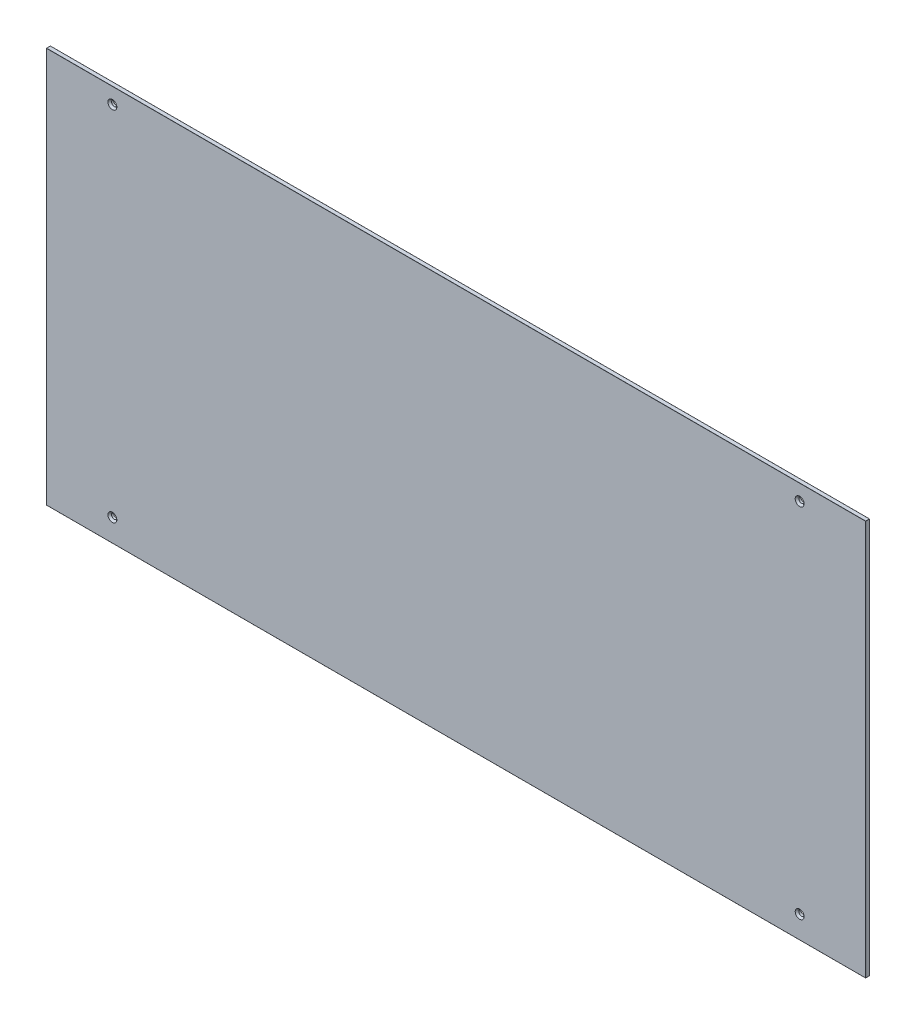
ISO-10303-21;
HEADER;
FILE_DESCRIPTION(('STEP AP214'),'2;1');
FILE_NAME('part.step','',(''),(''),'','','');
FILE_SCHEMA(('AUTOMOTIVE_DESIGN { 1 0 10303 214 1 1 1 1 }'));
ENDSEC;
DATA;
#1=APPLICATION_CONTEXT('core data for automotive mechanical design processes');
#2=APPLICATION_PROTOCOL_DEFINITION('international standard','automotive_design',2000,#1);
#3=PRODUCT_CONTEXT('',#1,'mechanical');
#4=PRODUCT('Part','Part','',(#3));
#5=PRODUCT_RELATED_PRODUCT_CATEGORY('part','',(#4));
#6=PRODUCT_DEFINITION_FORMATION('','',#4);
#7=PRODUCT_DEFINITION_CONTEXT('part definition',#1,'design');
#8=PRODUCT_DEFINITION('design','',#6,#7);
#9=PRODUCT_DEFINITION_SHAPE('','',#8);
#10=(LENGTH_UNIT() NAMED_UNIT(*) SI_UNIT(.MILLI.,.METRE.));
#11=(NAMED_UNIT(*) PLANE_ANGLE_UNIT() SI_UNIT($,.RADIAN.));
#12=(NAMED_UNIT(*) SI_UNIT($,.STERADIAN.) SOLID_ANGLE_UNIT());
#13=UNCERTAINTY_MEASURE_WITH_UNIT(LENGTH_MEASURE(1.E-05),#10,'distance_accuracy_value','');
#14=(GEOMETRIC_REPRESENTATION_CONTEXT(3) GLOBAL_UNCERTAINTY_ASSIGNED_CONTEXT((#13)) GLOBAL_UNIT_ASSIGNED_CONTEXT((#10,
#11,#12)) REPRESENTATION_CONTEXT('',''));
#15=CARTESIAN_POINT('',(0.,0.,0.));
#16=DIRECTION('',(0.,0.,1.));
#17=DIRECTION('',(1.,0.,0.));
#18=AXIS2_PLACEMENT_3D('',#15,#16,#17);
#19=CARTESIAN_POINT('',(621.,-300.,6.));
#20=DIRECTION('',(-1.,0.,0.));
#21=DIRECTION('',(0.,0.,1.));
#22=AXIS2_PLACEMENT_3D('',#19,#20,#21);
#23=PLANE('',#22);
#24=DIRECTION('',(0.,0.,-1.));
#25=VECTOR('',#24,1.);
#26=CARTESIAN_POINT('',(621.,-299.8,6.));
#27=LINE('',#26,#25);
#28=CARTESIAN_POINT('',(621.,-299.8,5.8));
#29=VERTEX_POINT('',#28);
#30=CARTESIAN_POINT('',(621.,-299.8,0.2));
#31=VERTEX_POINT('',#30);
#32=EDGE_CURVE('E180',#29,#31,#27,.T.);
#33=ORIENTED_EDGE('',*,*,#32,.T.);
#34=DIRECTION('',(0.,1.,0.));
#35=VECTOR('',#34,1.);
#36=CARTESIAN_POINT('',(621.,300.,0.2));
#37=LINE('',#36,#35);
#38=CARTESIAN_POINT('',(621.,299.8,0.2));
#39=VERTEX_POINT('',#38);
#40=EDGE_CURVE('E182',#31,#39,#37,.T.);
#41=ORIENTED_EDGE('',*,*,#40,.T.);
#42=DIRECTION('',(0.,0.,-1.));
#43=VECTOR('',#42,1.);
#44=CARTESIAN_POINT('',(621.,299.8,6.));
#45=LINE('',#44,#43);
#46=CARTESIAN_POINT('',(621.,299.8,5.8));
#47=VERTEX_POINT('',#46);
#48=EDGE_CURVE('E176',#39,#47,#45,.F.);
#49=ORIENTED_EDGE('',*,*,#48,.T.);
#50=DIRECTION('',(0.,1.,0.));
#51=VECTOR('',#50,1.);
#52=CARTESIAN_POINT('',(621.,-300.,5.8));
#53=LINE('',#52,#51);
#54=EDGE_CURVE('E178',#47,#29,#53,.F.);
#55=ORIENTED_EDGE('',*,*,#54,.T.);
#56=EDGE_LOOP('',(#33,#41,#49,#55));
#57=FACE_BOUND('',#56,.T.);
#58=ADVANCED_FACE('F32',(#57),#23,.F.);
#59=CARTESIAN_POINT('',(-621.,300.,6.));
#60=DIRECTION('',(0.,-1.,0.));
#61=DIRECTION('',(0.,0.,-1.));
#62=AXIS2_PLACEMENT_3D('',#59,#60,#61);
#63=PLANE('',#62);
#64=DIRECTION('',(-1.,0.,0.));
#65=VECTOR('',#64,1.);
#66=CARTESIAN_POINT('',(-621.,300.,5.8));
#67=LINE('',#66,#65);
#68=CARTESIAN_POINT('',(-620.8,300.,5.8));
#69=VERTEX_POINT('',#68);
#70=CARTESIAN_POINT('',(620.8,300.,5.8));
#71=VERTEX_POINT('',#70);
#72=EDGE_CURVE('E194',#69,#71,#67,.F.);
#73=ORIENTED_EDGE('',*,*,#72,.T.);
#74=DIRECTION('',(0.,0.,-1.));
#75=VECTOR('',#74,1.);
#76=CARTESIAN_POINT('',(620.8,300.,6.));
#77=LINE('',#76,#75);
#78=CARTESIAN_POINT('',(620.8,300.,0.2));
#79=VERTEX_POINT('',#78);
#80=EDGE_CURVE('E198',#71,#79,#77,.T.);
#81=ORIENTED_EDGE('',*,*,#80,.T.);
#82=DIRECTION('',(-1.,0.,0.));
#83=VECTOR('',#82,1.);
#84=CARTESIAN_POINT('',(-621.,300.,0.2));
#85=LINE('',#84,#83);
#86=CARTESIAN_POINT('',(-620.8,300.,0.2));
#87=VERTEX_POINT('',#86);
#88=EDGE_CURVE('E196',#79,#87,#85,.T.);
#89=ORIENTED_EDGE('',*,*,#88,.T.);
#90=DIRECTION('',(0.,0.,-1.));
#91=VECTOR('',#90,1.);
#92=CARTESIAN_POINT('',(-620.8,300.,6.));
#93=LINE('',#92,#91);
#94=EDGE_CURVE('E192',#87,#69,#93,.F.);
#95=ORIENTED_EDGE('',*,*,#94,.T.);
#96=EDGE_LOOP('',(#73,#81,#89,#95));
#97=FACE_BOUND('',#96,.T.);
#98=ADVANCED_FACE('F317',(#97),#63,.F.);
#99=CARTESIAN_POINT('',(-621.,-300.,6.));
#100=DIRECTION('',(1.,0.,0.));
#101=DIRECTION('',(0.,0.,-1.));
#102=AXIS2_PLACEMENT_3D('',#99,#100,#101);
#103=PLANE('',#102);
#104=DIRECTION('',(0.,-1.,0.));
#105=VECTOR('',#104,1.);
#106=CARTESIAN_POINT('',(-621.,-300.,0.2));
#107=LINE('',#106,#105);
#108=CARTESIAN_POINT('',(-621.,299.8,0.2));
#109=VERTEX_POINT('',#108);
#110=CARTESIAN_POINT('',(-621.,-299.8,0.2));
#111=VERTEX_POINT('',#110);
#112=EDGE_CURVE('E41',#109,#111,#107,.T.);
#113=ORIENTED_EDGE('',*,*,#112,.T.);
#114=DIRECTION('',(0.,0.,-1.));
#115=VECTOR('',#114,1.);
#116=CARTESIAN_POINT('',(-621.,-299.8,6.));
#117=LINE('',#116,#115);
#118=CARTESIAN_POINT('',(-621.,-299.8,5.8));
#119=VERTEX_POINT('',#118);
#120=EDGE_CURVE('E11',#111,#119,#117,.F.);
#121=ORIENTED_EDGE('',*,*,#120,.T.);
#122=DIRECTION('',(0.,-1.,0.));
#123=VECTOR('',#122,1.);
#124=CARTESIAN_POINT('',(-621.,-300.,5.8));
#125=LINE('',#124,#123);
#126=CARTESIAN_POINT('',(-621.,299.8,5.8));
#127=VERTEX_POINT('',#126);
#128=EDGE_CURVE('E201',#119,#127,#125,.F.);
#129=ORIENTED_EDGE('',*,*,#128,.T.);
#130=DIRECTION('',(0.,0.,-1.));
#131=VECTOR('',#130,1.);
#132=CARTESIAN_POINT('',(-621.,299.8,6.));
#133=LINE('',#132,#131);
#134=EDGE_CURVE('E52',#127,#109,#133,.T.);
#135=ORIENTED_EDGE('',*,*,#134,.T.);
#136=EDGE_LOOP('',(#113,#121,#129,#135));
#137=FACE_BOUND('',#136,.T.);
#138=ADVANCED_FACE('F323',(#137),#103,.F.);
#139=CARTESIAN_POINT('',(-621.,-300.,6.));
#140=DIRECTION('',(0.,1.,0.));
#141=DIRECTION('',(0.,0.,1.));
#142=AXIS2_PLACEMENT_3D('',#139,#140,#141);
#143=PLANE('',#142);
#144=DIRECTION('',(0.,0.,-1.));
#145=VECTOR('',#144,1.);
#146=CARTESIAN_POINT('',(-620.8,-300.,6.));
#147=LINE('',#146,#145);
#148=CARTESIAN_POINT('',(-620.8,-300.,5.8));
#149=VERTEX_POINT('',#148);
#150=CARTESIAN_POINT('',(-620.8,-300.,0.2));
#151=VERTEX_POINT('',#150);
#152=EDGE_CURVE('E125',#149,#151,#147,.T.);
#153=ORIENTED_EDGE('',*,*,#152,.T.);
#154=DIRECTION('',(1.,0.,0.));
#155=VECTOR('',#154,1.);
#156=CARTESIAN_POINT('',(621.,-300.,0.2));
#157=LINE('',#156,#155);
#158=CARTESIAN_POINT('',(620.8,-300.,0.2));
#159=VERTEX_POINT('',#158);
#160=EDGE_CURVE('E165',#151,#159,#157,.T.);
#161=ORIENTED_EDGE('',*,*,#160,.T.);
#162=DIRECTION('',(0.,0.,-1.));
#163=VECTOR('',#162,1.);
#164=CARTESIAN_POINT('',(620.8,-300.,6.));
#165=LINE('',#164,#163);
#166=CARTESIAN_POINT('',(620.8,-300.,5.8));
#167=VERTEX_POINT('',#166);
#168=EDGE_CURVE('E128',#159,#167,#165,.F.);
#169=ORIENTED_EDGE('',*,*,#168,.T.);
#170=DIRECTION('',(1.,0.,0.));
#171=VECTOR('',#170,1.);
#172=CARTESIAN_POINT('',(-621.,-300.,5.8));
#173=LINE('',#172,#171);
#174=EDGE_CURVE('E120',#167,#149,#173,.F.);
#175=ORIENTED_EDGE('',*,*,#174,.T.);
#176=EDGE_LOOP('',(#153,#161,#169,#175));
#177=FACE_BOUND('',#176,.T.);
#178=ADVANCED_FACE('F122',(#177),#143,.F.);
#179=CARTESIAN_POINT('',(0.,0.,6.));
#180=DIRECTION('',(0.,0.,-1.));
#181=DIRECTION('',(-1.,0.,0.));
#182=AXIS2_PLACEMENT_3D('',#179,#180,#181);
#183=PLANE('',#182);
#184=DIRECTION('',(0.,-1.,0.));
#185=VECTOR('',#184,1.);
#186=CARTESIAN_POINT('',(-620.8,0.,6.));
#187=LINE('',#186,#185);
#188=CARTESIAN_POINT('',(-620.8,299.8,6.));
#189=VERTEX_POINT('',#188);
#190=CARTESIAN_POINT('',(-620.8,-299.8,6.));
#191=VERTEX_POINT('',#190);
#192=EDGE_CURVE('E185',#189,#191,#187,.T.);
#193=ORIENTED_EDGE('',*,*,#192,.T.);
#194=DIRECTION('',(1.,0.,0.));
#195=VECTOR('',#194,1.);
#196=CARTESIAN_POINT('',(0.,-299.8,6.));
#197=LINE('',#196,#195);
#198=CARTESIAN_POINT('',(620.8,-299.8,6.));
#199=VERTEX_POINT('',#198);
#200=EDGE_CURVE('E139',#191,#199,#197,.T.);
#201=ORIENTED_EDGE('',*,*,#200,.T.);
#202=DIRECTION('',(0.,1.,0.));
#203=VECTOR('',#202,1.);
#204=CARTESIAN_POINT('',(620.8,0.,6.));
#205=LINE('',#204,#203);
#206=CARTESIAN_POINT('',(620.8,299.8,6.));
#207=VERTEX_POINT('',#206);
#208=EDGE_CURVE('E189',#199,#207,#205,.T.);
#209=ORIENTED_EDGE('',*,*,#208,.T.);
#210=DIRECTION('',(-1.,0.,0.));
#211=VECTOR('',#210,1.);
#212=CARTESIAN_POINT('',(0.,299.8,6.));
#213=LINE('',#212,#211);
#214=EDGE_CURVE('E187',#207,#189,#213,.T.);
#215=ORIENTED_EDGE('',*,*,#214,.T.);
#216=EDGE_LOOP('',(#193,#201,#209,#215));
#217=FACE_BOUND('',#216,.T.);
#218=CARTESIAN_POINT('',(-521.,-266.,6.));
#219=DIRECTION('',(0.,0.,-1.));
#220=DIRECTION('',(-1.,0.,0.));
#221=AXIS2_PLACEMENT_3D('',#218,#219,#220);
#222=CIRCLE('',#221,6.75000000000014);
#223=CARTESIAN_POINT('',(-527.75,-266.,6.));
#224=VERTEX_POINT('',#223);
#225=EDGE_CURVE('E289',#224,#224,#222,.T.);
#226=ORIENTED_EDGE('',*,*,#225,.T.);
#227=EDGE_LOOP('',(#226));
#228=FACE_BOUND('',#227,.T.);
#229=CARTESIAN_POINT('',(521.,-266.,6.));
#230=DIRECTION('',(0.,0.,-1.));
#231=DIRECTION('',(-1.,0.,0.));
#232=AXIS2_PLACEMENT_3D('',#229,#230,#231);
#233=CIRCLE('',#232,6.75000000000014);
#234=CARTESIAN_POINT('',(514.25,-266.,6.));
#235=VERTEX_POINT('',#234);
#236=EDGE_CURVE('E286',#235,#235,#233,.T.);
#237=ORIENTED_EDGE('',*,*,#236,.T.);
#238=EDGE_LOOP('',(#237));
#239=FACE_BOUND('',#238,.T.);
#240=CARTESIAN_POINT('',(521.,276.,6.));
#241=DIRECTION('',(0.,0.,-1.));
#242=DIRECTION('',(-1.,0.,0.));
#243=AXIS2_PLACEMENT_3D('',#240,#241,#242);
#244=CIRCLE('',#243,6.75000000000014);
#245=CARTESIAN_POINT('',(514.25,276.,6.));
#246=VERTEX_POINT('',#245);
#247=EDGE_CURVE('E283',#246,#246,#244,.T.);
#248=ORIENTED_EDGE('',*,*,#247,.T.);
#249=EDGE_LOOP('',(#248));
#250=FACE_BOUND('',#249,.T.);
#251=CARTESIAN_POINT('',(-521.,276.,6.));
#252=DIRECTION('',(0.,0.,-1.));
#253=DIRECTION('',(-1.,0.,0.));
#254=AXIS2_PLACEMENT_3D('',#251,#252,#253);
#255=CIRCLE('',#254,6.75000000000014);
#256=CARTESIAN_POINT('',(-527.75,276.,6.));
#257=VERTEX_POINT('',#256);
#258=EDGE_CURVE('E280',#257,#257,#255,.T.);
#259=ORIENTED_EDGE('',*,*,#258,.T.);
#260=EDGE_LOOP('',(#259));
#261=FACE_BOUND('',#260,.T.);
#262=ADVANCED_FACE('F342',(#217,#228,#239,#250,#261),#183,.F.);
#263=CARTESIAN_POINT('',(0.,0.,0.));
#264=DIRECTION('',(0.,0.,-1.));
#265=DIRECTION('',(-1.,0.,0.));
#266=AXIS2_PLACEMENT_3D('',#263,#264,#265);
#267=PLANE('',#266);
#268=DIRECTION('',(0.,1.,0.));
#269=VECTOR('',#268,1.);
#270=CARTESIAN_POINT('',(620.8,-300.,0.));
#271=LINE('',#270,#269);
#272=CARTESIAN_POINT('',(620.8,299.8,0.));
#273=VERTEX_POINT('',#272);
#274=CARTESIAN_POINT('',(620.8,-299.8,0.));
#275=VERTEX_POINT('',#274);
#276=EDGE_CURVE('E171',#273,#275,#271,.F.);
#277=ORIENTED_EDGE('',*,*,#276,.T.);
#278=DIRECTION('',(1.,0.,0.));
#279=VECTOR('',#278,1.);
#280=CARTESIAN_POINT('',(-621.,-299.8,0.));
#281=LINE('',#280,#279);
#282=CARTESIAN_POINT('',(-620.8,-299.8,0.));
#283=VERTEX_POINT('',#282);
#284=EDGE_CURVE('E173',#275,#283,#281,.F.);
#285=ORIENTED_EDGE('',*,*,#284,.T.);
#286=DIRECTION('',(0.,-1.,0.));
#287=VECTOR('',#286,1.);
#288=CARTESIAN_POINT('',(-620.8,300.,0.));
#289=LINE('',#288,#287);
#290=CARTESIAN_POINT('',(-620.8,299.8,0.));
#291=VERTEX_POINT('',#290);
#292=EDGE_CURVE('E167',#283,#291,#289,.F.);
#293=ORIENTED_EDGE('',*,*,#292,.T.);
#294=DIRECTION('',(-1.,0.,0.));
#295=VECTOR('',#294,1.);
#296=CARTESIAN_POINT('',(621.,299.8,0.));
#297=LINE('',#296,#295);
#298=EDGE_CURVE('E169',#291,#273,#297,.F.);
#299=ORIENTED_EDGE('',*,*,#298,.T.);
#300=EDGE_LOOP('',(#277,#285,#293,#299));
#301=FACE_BOUND('',#300,.T.);
#302=CARTESIAN_POINT('',(-521.,-266.,0.));
#303=DIRECTION('',(0.,0.,1.));
#304=DIRECTION('',(1.,0.,0.));
#305=AXIS2_PLACEMENT_3D('',#302,#303,#304);
#306=CIRCLE('',#305,3.99999999999999);
#307=CARTESIAN_POINT('',(-517.,-266.,0.));
#308=VERTEX_POINT('',#307);
#309=EDGE_CURVE('E258',#308,#308,#306,.T.);
#310=ORIENTED_EDGE('',*,*,#309,.T.);
#311=EDGE_LOOP('',(#310));
#312=FACE_BOUND('',#311,.T.);
#313=CARTESIAN_POINT('',(521.,-266.,0.));
#314=DIRECTION('',(0.,0.,1.));
#315=DIRECTION('',(1.,0.,0.));
#316=AXIS2_PLACEMENT_3D('',#313,#314,#315);
#317=CIRCLE('',#316,3.99999999999999);
#318=CARTESIAN_POINT('',(525.,-266.,0.));
#319=VERTEX_POINT('',#318);
#320=EDGE_CURVE('E264',#319,#319,#317,.T.);
#321=ORIENTED_EDGE('',*,*,#320,.T.);
#322=EDGE_LOOP('',(#321));
#323=FACE_BOUND('',#322,.T.);
#324=CARTESIAN_POINT('',(521.,276.,0.));
#325=DIRECTION('',(0.,0.,1.));
#326=DIRECTION('',(1.,0.,0.));
#327=AXIS2_PLACEMENT_3D('',#324,#325,#326);
#328=CIRCLE('',#327,3.99999999999999);
#329=CARTESIAN_POINT('',(525.,276.,0.));
#330=VERTEX_POINT('',#329);
#331=EDGE_CURVE('E269',#330,#330,#328,.T.);
#332=ORIENTED_EDGE('',*,*,#331,.T.);
#333=EDGE_LOOP('',(#332));
#334=FACE_BOUND('',#333,.T.);
#335=CARTESIAN_POINT('',(-521.,276.,0.));
#336=DIRECTION('',(0.,0.,1.));
#337=DIRECTION('',(1.,0.,0.));
#338=AXIS2_PLACEMENT_3D('',#335,#336,#337);
#339=CIRCLE('',#338,3.99999999999999);
#340=CARTESIAN_POINT('',(-517.,276.,0.));
#341=VERTEX_POINT('',#340);
#342=EDGE_CURVE('E274',#341,#341,#339,.T.);
#343=ORIENTED_EDGE('',*,*,#342,.T.);
#344=EDGE_LOOP('',(#343));
#345=FACE_BOUND('',#344,.T.);
#346=ADVANCED_FACE('F345',(#301,#312,#323,#334,#345),#267,.T.);
#347=CARTESIAN_POINT('',(-521.,276.,0.));
#348=DIRECTION('',(0.,0.,1.));
#349=DIRECTION('',(1.,0.,0.));
#350=AXIS2_PLACEMENT_3D('',#347,#348,#349);
#351=CYLINDRICAL_SURFACE('',#350,3.99999999999999);
#352=CARTESIAN_POINT('',(-521.,276.,3.24999999999983));
#353=DIRECTION('',(0.,0.,-1.));
#354=DIRECTION('',(-1.,0.,0.));
#355=AXIS2_PLACEMENT_3D('',#352,#353,#354);
#356=CIRCLE('',#355,3.99999999999999);
#357=CARTESIAN_POINT('',(-525.,276.,3.24999999999983));
#358=VERTEX_POINT('',#357);
#359=EDGE_CURVE('E157',#358,#358,#356,.F.);
#360=ORIENTED_EDGE('',*,*,#359,.T.);
#361=EDGE_LOOP('',(#360));
#362=FACE_BOUND('',#361,.T.);
#363=ORIENTED_EDGE('',*,*,#342,.F.);
#364=EDGE_LOOP('',(#363));
#365=FACE_BOUND('',#364,.T.);
#366=ADVANCED_FACE('F355',(#362,#365),#351,.F.);
#367=CARTESIAN_POINT('',(521.,276.,0.));
#368=DIRECTION('',(0.,0.,1.));
#369=DIRECTION('',(1.,0.,0.));
#370=AXIS2_PLACEMENT_3D('',#367,#368,#369);
#371=CYLINDRICAL_SURFACE('',#370,3.99999999999999);
#372=CARTESIAN_POINT('',(521.,276.,3.24999999999983));
#373=DIRECTION('',(0.,0.,-1.));
#374=DIRECTION('',(-1.,0.,0.));
#375=AXIS2_PLACEMENT_3D('',#372,#373,#374);
#376=CIRCLE('',#375,3.99999999999999);
#377=CARTESIAN_POINT('',(517.,276.,3.24999999999983));
#378=VERTEX_POINT('',#377);
#379=EDGE_CURVE('E160',#378,#378,#376,.F.);
#380=ORIENTED_EDGE('',*,*,#379,.T.);
#381=EDGE_LOOP('',(#380));
#382=FACE_BOUND('',#381,.T.);
#383=ORIENTED_EDGE('',*,*,#331,.F.);
#384=EDGE_LOOP('',(#383));
#385=FACE_BOUND('',#384,.T.);
#386=ADVANCED_FACE('F297',(#382,#385),#371,.F.);
#387=CARTESIAN_POINT('',(521.,-266.,0.));
#388=DIRECTION('',(0.,0.,1.));
#389=DIRECTION('',(1.,0.,0.));
#390=AXIS2_PLACEMENT_3D('',#387,#388,#389);
#391=CYLINDRICAL_SURFACE('',#390,3.99999999999999);
#392=CARTESIAN_POINT('',(521.,-266.,3.24999999999983));
#393=DIRECTION('',(0.,0.,-1.));
#394=DIRECTION('',(-1.,0.,0.));
#395=AXIS2_PLACEMENT_3D('',#392,#393,#394);
#396=CIRCLE('',#395,3.99999999999999);
#397=CARTESIAN_POINT('',(517.,-266.,3.24999999999983));
#398=VERTEX_POINT('',#397);
#399=EDGE_CURVE('E292',#398,#398,#396,.F.);
#400=ORIENTED_EDGE('',*,*,#399,.T.);
#401=EDGE_LOOP('',(#400));
#402=FACE_BOUND('',#401,.T.);
#403=ORIENTED_EDGE('',*,*,#320,.F.);
#404=EDGE_LOOP('',(#403));
#405=FACE_BOUND('',#404,.T.);
#406=ADVANCED_FACE('F334',(#402,#405),#391,.F.);
#407=CARTESIAN_POINT('',(-521.,-266.,0.));
#408=DIRECTION('',(0.,0.,1.));
#409=DIRECTION('',(1.,0.,0.));
#410=AXIS2_PLACEMENT_3D('',#407,#408,#409);
#411=CYLINDRICAL_SURFACE('',#410,3.99999999999999);
#412=CARTESIAN_POINT('',(-521.,-266.,3.24999999999983));
#413=DIRECTION('',(0.,0.,-1.));
#414=DIRECTION('',(-1.,0.,0.));
#415=AXIS2_PLACEMENT_3D('',#412,#413,#414);
#416=CIRCLE('',#415,3.99999999999999);
#417=CARTESIAN_POINT('',(-525.,-266.,3.24999999999983));
#418=VERTEX_POINT('',#417);
#419=EDGE_CURVE('E277',#418,#418,#416,.F.);
#420=ORIENTED_EDGE('',*,*,#419,.T.);
#421=EDGE_LOOP('',(#420));
#422=FACE_BOUND('',#421,.T.);
#423=ORIENTED_EDGE('',*,*,#309,.F.);
#424=EDGE_LOOP('',(#423));
#425=FACE_BOUND('',#424,.T.);
#426=ADVANCED_FACE('F329',(#422,#425),#411,.F.);
#427=CARTESIAN_POINT('',(-521.,-266.,3.24999999999983));
#428=DIRECTION('',(0.,0.,1.));
#429=DIRECTION('',(1.,0.,0.));
#430=AXIS2_PLACEMENT_3D('',#427,#428,#429);
#431=CONICAL_SURFACE('',#430,3.99999999999999,0.785398163397446);
#432=ORIENTED_EDGE('',*,*,#225,.F.);
#433=EDGE_LOOP('',(#432));
#434=FACE_BOUND('',#433,.T.);
#435=ORIENTED_EDGE('',*,*,#419,.F.);
#436=EDGE_LOOP('',(#435));
#437=FACE_BOUND('',#436,.T.);
#438=ADVANCED_FACE('F312',(#434,#437),#431,.F.);
#439=CARTESIAN_POINT('',(521.,-266.,3.24999999999983));
#440=DIRECTION('',(0.,0.,1.));
#441=DIRECTION('',(1.,0.,0.));
#442=AXIS2_PLACEMENT_3D('',#439,#440,#441);
#443=CONICAL_SURFACE('',#442,3.99999999999999,0.785398163397446);
#444=ORIENTED_EDGE('',*,*,#236,.F.);
#445=EDGE_LOOP('',(#444));
#446=FACE_BOUND('',#445,.T.);
#447=ORIENTED_EDGE('',*,*,#399,.F.);
#448=EDGE_LOOP('',(#447));
#449=FACE_BOUND('',#448,.T.);
#450=ADVANCED_FACE('F303',(#446,#449),#443,.F.);
#451=CARTESIAN_POINT('',(521.,276.,3.24999999999983));
#452=DIRECTION('',(0.,0.,1.));
#453=DIRECTION('',(1.,0.,0.));
#454=AXIS2_PLACEMENT_3D('',#451,#452,#453);
#455=CONICAL_SURFACE('',#454,3.99999999999999,0.785398163397446);
#456=ORIENTED_EDGE('',*,*,#247,.F.);
#457=EDGE_LOOP('',(#456));
#458=FACE_BOUND('',#457,.T.);
#459=ORIENTED_EDGE('',*,*,#379,.F.);
#460=EDGE_LOOP('',(#459));
#461=FACE_BOUND('',#460,.T.);
#462=ADVANCED_FACE('F300',(#458,#461),#455,.F.);
#463=CARTESIAN_POINT('',(-521.,276.,3.24999999999983));
#464=DIRECTION('',(0.,0.,1.));
#465=DIRECTION('',(1.,0.,0.));
#466=AXIS2_PLACEMENT_3D('',#463,#464,#465);
#467=CONICAL_SURFACE('',#466,3.99999999999999,0.785398163397446);
#468=ORIENTED_EDGE('',*,*,#258,.F.);
#469=EDGE_LOOP('',(#468));
#470=FACE_BOUND('',#469,.T.);
#471=ORIENTED_EDGE('',*,*,#359,.F.);
#472=EDGE_LOOP('',(#471));
#473=FACE_BOUND('',#472,.T.);
#474=ADVANCED_FACE('F302',(#470,#473),#467,.F.);
#475=CARTESIAN_POINT('',(0.,299.8,5.8));
#476=DIRECTION('',(-1.,0.,0.));
#477=DIRECTION('',(0.,0.,1.));
#478=AXIS2_PLACEMENT_3D('',#475,#476,#477);
#479=CYLINDRICAL_SURFACE('',#478,0.2);
#480=CARTESIAN_POINT('',(-620.8,299.8,5.8));
#481=DIRECTION('',(-1.,0.,0.));
#482=DIRECTION('',(0.,0.,1.));
#483=AXIS2_PLACEMENT_3D('',#480,#481,#482);
#484=CIRCLE('',#483,0.2);
#485=EDGE_CURVE('E36',#189,#69,#484,.T.);
#486=ORIENTED_EDGE('',*,*,#485,.F.);
#487=ORIENTED_EDGE('',*,*,#214,.F.);
#488=CARTESIAN_POINT('',(620.8,299.8,5.8));
#489=DIRECTION('',(1.,0.,5.55111512312579E-13));
#490=DIRECTION('',(5.55111512312579E-13,0.,-1.));
#491=AXIS2_PLACEMENT_3D('',#488,#489,#490);
#492=CIRCLE('',#491,0.2);
#493=EDGE_CURVE('E251',#71,#207,#492,.T.);
#494=ORIENTED_EDGE('',*,*,#493,.F.);
#495=ORIENTED_EDGE('',*,*,#72,.F.);
#496=EDGE_LOOP('',(#486,#487,#494,#495));
#497=FACE_BOUND('',#496,.T.);
#498=ADVANCED_FACE('F34',(#497),#479,.T.);
#499=CARTESIAN_POINT('',(-620.8,299.8,5.8));
#500=DIRECTION('',(0.,0.,1.));
#501=DIRECTION('',(1.,0.,0.));
#502=AXIS2_PLACEMENT_3D('',#499,#500,#501);
#503=SPHERICAL_SURFACE('',#502,0.2);
#504=CARTESIAN_POINT('',(-620.8,299.8,5.8));
#505=DIRECTION('',(0.,1.,0.));
#506=DIRECTION('',(0.,0.,1.));
#507=AXIS2_PLACEMENT_3D('',#504,#505,#506);
#508=CIRCLE('',#507,0.2);
#509=EDGE_CURVE('E246',#189,#127,#508,.F.);
#510=ORIENTED_EDGE('',*,*,#509,.F.);
#511=ORIENTED_EDGE('',*,*,#485,.T.);
#512=CARTESIAN_POINT('',(-620.8,299.8,5.8));
#513=DIRECTION('',(0.,0.,1.));
#514=DIRECTION('',(1.,0.,0.));
#515=AXIS2_PLACEMENT_3D('',#512,#513,#514);
#516=CIRCLE('',#515,0.2);
#517=EDGE_CURVE('E249',#127,#69,#516,.F.);
#518=ORIENTED_EDGE('',*,*,#517,.F.);
#519=EDGE_LOOP('',(#510,#511,#518));
#520=FACE_BOUND('',#519,.T.);
#521=ADVANCED_FACE('F395',(#520),#503,.T.);
#522=CARTESIAN_POINT('',(620.8,299.8,5.8));
#523=DIRECTION('',(0.,0.,1.));
#524=DIRECTION('',(1.,0.,0.));
#525=AXIS2_PLACEMENT_3D('',#522,#523,#524);
#526=SPHERICAL_SURFACE('',#525,0.2);
#527=CARTESIAN_POINT('',(620.8,299.8,5.8));
#528=DIRECTION('',(0.,0.,1.));
#529=DIRECTION('',(1.,0.,0.));
#530=AXIS2_PLACEMENT_3D('',#527,#528,#529);
#531=CIRCLE('',#530,0.2);
#532=EDGE_CURVE('E240',#71,#47,#531,.F.);
#533=ORIENTED_EDGE('',*,*,#532,.F.);
#534=ORIENTED_EDGE('',*,*,#493,.T.);
#535=CARTESIAN_POINT('',(620.8,299.8,5.8));
#536=DIRECTION('',(0.,1.,0.));
#537=DIRECTION('',(0.,0.,1.));
#538=AXIS2_PLACEMENT_3D('',#535,#536,#537);
#539=CIRCLE('',#538,0.2);
#540=EDGE_CURVE('E243',#47,#207,#539,.F.);
#541=ORIENTED_EDGE('',*,*,#540,.F.);
#542=EDGE_LOOP('',(#533,#534,#541));
#543=FACE_BOUND('',#542,.T.);
#544=ADVANCED_FACE('F405',(#543),#526,.T.);
#545=CARTESIAN_POINT('',(-620.8,299.8,6.));
#546=DIRECTION('',(0.,0.,-1.));
#547=DIRECTION('',(-1.,0.,0.));
#548=AXIS2_PLACEMENT_3D('',#545,#546,#547);
#549=CYLINDRICAL_SURFACE('',#548,0.2);
#550=ORIENTED_EDGE('',*,*,#517,.T.);
#551=ORIENTED_EDGE('',*,*,#94,.F.);
#552=CARTESIAN_POINT('',(-620.8,299.8,0.2));
#553=DIRECTION('',(0.,0.,-1.));
#554=DIRECTION('',(-1.,0.,0.));
#555=AXIS2_PLACEMENT_3D('',#552,#553,#554);
#556=CIRCLE('',#555,0.2);
#557=EDGE_CURVE('E234',#109,#87,#556,.T.);
#558=ORIENTED_EDGE('',*,*,#557,.F.);
#559=ORIENTED_EDGE('',*,*,#134,.F.);
#560=EDGE_LOOP('',(#550,#551,#558,#559));
#561=FACE_BOUND('',#560,.T.);
#562=ADVANCED_FACE('F413',(#561),#549,.T.);
#563=CARTESIAN_POINT('',(-620.8,0.,5.8));
#564=DIRECTION('',(0.,-1.,0.));
#565=DIRECTION('',(0.,0.,-1.));
#566=AXIS2_PLACEMENT_3D('',#563,#564,#565);
#567=CYLINDRICAL_SURFACE('',#566,0.2);
#568=ORIENTED_EDGE('',*,*,#509,.T.);
#569=ORIENTED_EDGE('',*,*,#128,.F.);
#570=CARTESIAN_POINT('',(-620.8,-299.8,5.8));
#571=DIRECTION('',(0.,-1.,0.));
#572=DIRECTION('',(0.,0.,-1.));
#573=AXIS2_PLACEMENT_3D('',#570,#571,#572);
#574=CIRCLE('',#573,0.2);
#575=EDGE_CURVE('E143',#191,#119,#574,.T.);
#576=ORIENTED_EDGE('',*,*,#575,.F.);
#577=ORIENTED_EDGE('',*,*,#192,.F.);
#578=EDGE_LOOP('',(#568,#569,#576,#577));
#579=FACE_BOUND('',#578,.T.);
#580=ADVANCED_FACE('F422',(#579),#567,.T.);
#581=CARTESIAN_POINT('',(0.,-299.8,5.8));
#582=DIRECTION('',(1.,0.,0.));
#583=DIRECTION('',(0.,0.,-1.));
#584=AXIS2_PLACEMENT_3D('',#581,#582,#583);
#585=CYLINDRICAL_SURFACE('',#584,0.2);
#586=CARTESIAN_POINT('',(620.8,-299.8,5.8));
#587=DIRECTION('',(1.,0.,0.));
#588=DIRECTION('',(0.,0.,-1.));
#589=AXIS2_PLACEMENT_3D('',#586,#587,#588);
#590=CIRCLE('',#589,0.2);
#591=EDGE_CURVE('E144',#199,#167,#590,.T.);
#592=ORIENTED_EDGE('',*,*,#591,.F.);
#593=ORIENTED_EDGE('',*,*,#200,.F.);
#594=CARTESIAN_POINT('',(-620.8,-299.8,5.8));
#595=DIRECTION('',(-1.,0.,0.));
#596=DIRECTION('',(0.,0.,1.));
#597=AXIS2_PLACEMENT_3D('',#594,#595,#596);
#598=CIRCLE('',#597,0.2);
#599=EDGE_CURVE('E135',#149,#191,#598,.T.);
#600=ORIENTED_EDGE('',*,*,#599,.F.);
#601=ORIENTED_EDGE('',*,*,#174,.F.);
#602=EDGE_LOOP('',(#592,#593,#600,#601));
#603=FACE_BOUND('',#602,.T.);
#604=ADVANCED_FACE('F137',(#603),#585,.T.);
#605=CARTESIAN_POINT('',(620.8,0.,5.8));
#606=DIRECTION('',(0.,1.,0.));
#607=DIRECTION('',(0.,0.,1.));
#608=AXIS2_PLACEMENT_3D('',#605,#606,#607);
#609=CYLINDRICAL_SURFACE('',#608,0.2);
#610=ORIENTED_EDGE('',*,*,#540,.T.);
#611=ORIENTED_EDGE('',*,*,#208,.F.);
#612=CARTESIAN_POINT('',(620.8,-299.8,5.8));
#613=DIRECTION('',(0.,-1.,0.));
#614=DIRECTION('',(0.,0.,-1.));
#615=AXIS2_PLACEMENT_3D('',#612,#613,#614);
#616=CIRCLE('',#615,0.2);
#617=EDGE_CURVE('E230',#29,#199,#616,.T.);
#618=ORIENTED_EDGE('',*,*,#617,.F.);
#619=ORIENTED_EDGE('',*,*,#54,.F.);
#620=EDGE_LOOP('',(#610,#611,#618,#619));
#621=FACE_BOUND('',#620,.T.);
#622=ADVANCED_FACE('F441',(#621),#609,.T.);
#623=CARTESIAN_POINT('',(620.8,299.8,6.));
#624=DIRECTION('',(0.,0.,-1.));
#625=DIRECTION('',(-1.,0.,0.));
#626=AXIS2_PLACEMENT_3D('',#623,#624,#625);
#627=CYLINDRICAL_SURFACE('',#626,0.2);
#628=ORIENTED_EDGE('',*,*,#532,.T.);
#629=ORIENTED_EDGE('',*,*,#48,.F.);
#630=CARTESIAN_POINT('',(620.8,299.8,0.2));
#631=DIRECTION('',(0.,0.,-1.));
#632=DIRECTION('',(-1.,0.,0.));
#633=AXIS2_PLACEMENT_3D('',#630,#631,#632);
#634=CIRCLE('',#633,0.2);
#635=EDGE_CURVE('E227',#79,#39,#634,.T.);
#636=ORIENTED_EDGE('',*,*,#635,.F.);
#637=ORIENTED_EDGE('',*,*,#80,.F.);
#638=EDGE_LOOP('',(#628,#629,#636,#637));
#639=FACE_BOUND('',#638,.T.);
#640=ADVANCED_FACE('F450',(#639),#627,.T.);
#641=CARTESIAN_POINT('',(-621.,299.8,0.2));
#642=DIRECTION('',(1.,0.,0.));
#643=DIRECTION('',(0.,0.,-1.));
#644=AXIS2_PLACEMENT_3D('',#641,#642,#643);
#645=CYLINDRICAL_SURFACE('',#644,0.2);
#646=CARTESIAN_POINT('',(-620.8,299.8,0.2));
#647=DIRECTION('',(-1.,0.,0.));
#648=DIRECTION('',(0.,0.,1.));
#649=AXIS2_PLACEMENT_3D('',#646,#647,#648);
#650=CIRCLE('',#649,0.2);
#651=EDGE_CURVE('E237',#87,#291,#650,.T.);
#652=ORIENTED_EDGE('',*,*,#651,.F.);
#653=ORIENTED_EDGE('',*,*,#88,.F.);
#654=CARTESIAN_POINT('',(620.8,299.8,0.2));
#655=DIRECTION('',(1.,-5.55111512312639E-13,0.));
#656=DIRECTION('',(5.55111512312639E-13,1.,0.));
#657=AXIS2_PLACEMENT_3D('',#654,#655,#656);
#658=CIRCLE('',#657,0.2);
#659=EDGE_CURVE('E225',#273,#79,#658,.T.);
#660=ORIENTED_EDGE('',*,*,#659,.F.);
#661=ORIENTED_EDGE('',*,*,#298,.F.);
#662=EDGE_LOOP('',(#652,#653,#660,#661));
#663=FACE_BOUND('',#662,.T.);
#664=ADVANCED_FACE('F460',(#663),#645,.T.);
#665=CARTESIAN_POINT('',(-620.8,299.8,0.2));
#666=DIRECTION('',(0.,0.,1.));
#667=DIRECTION('',(1.,0.,0.));
#668=AXIS2_PLACEMENT_3D('',#665,#666,#667);
#669=SPHERICAL_SURFACE('',#668,0.2);
#670=ORIENTED_EDGE('',*,*,#557,.T.);
#671=ORIENTED_EDGE('',*,*,#651,.T.);
#672=CARTESIAN_POINT('',(-620.8,299.8,0.2));
#673=DIRECTION('',(0.,1.,0.));
#674=DIRECTION('',(0.,0.,1.));
#675=AXIS2_PLACEMENT_3D('',#672,#673,#674);
#676=CIRCLE('',#675,0.2);
#677=EDGE_CURVE('E150',#109,#291,#676,.F.);
#678=ORIENTED_EDGE('',*,*,#677,.F.);
#679=EDGE_LOOP('',(#670,#671,#678));
#680=FACE_BOUND('',#679,.T.);
#681=ADVANCED_FACE('F470',(#680),#669,.T.);
#682=CARTESIAN_POINT('',(-620.8,-299.8,5.8));
#683=DIRECTION('',(0.,0.,1.));
#684=DIRECTION('',(1.,0.,0.));
#685=AXIS2_PLACEMENT_3D('',#682,#683,#684);
#686=SPHERICAL_SURFACE('',#685,0.2);
#687=ORIENTED_EDGE('',*,*,#599,.T.);
#688=ORIENTED_EDGE('',*,*,#575,.T.);
#689=CARTESIAN_POINT('',(-620.8,-299.8,5.8));
#690=DIRECTION('',(0.,0.,1.));
#691=DIRECTION('',(1.,0.,0.));
#692=AXIS2_PLACEMENT_3D('',#689,#690,#691);
#693=CIRCLE('',#692,0.2);
#694=EDGE_CURVE('E146',#149,#119,#693,.F.);
#695=ORIENTED_EDGE('',*,*,#694,.F.);
#696=EDGE_LOOP('',(#687,#688,#695));
#697=FACE_BOUND('',#696,.T.);
#698=ADVANCED_FACE('F147',(#697),#686,.T.);
#699=CARTESIAN_POINT('',(620.8,-299.8,5.8));
#700=DIRECTION('',(0.,0.,1.));
#701=DIRECTION('',(1.,0.,0.));
#702=AXIS2_PLACEMENT_3D('',#699,#700,#701);
#703=SPHERICAL_SURFACE('',#702,0.2);
#704=ORIENTED_EDGE('',*,*,#617,.T.);
#705=ORIENTED_EDGE('',*,*,#591,.T.);
#706=CARTESIAN_POINT('',(620.8,-299.8,5.8));
#707=DIRECTION('',(0.,0.,1.));
#708=DIRECTION('',(1.,0.,0.));
#709=AXIS2_PLACEMENT_3D('',#706,#707,#708);
#710=CIRCLE('',#709,0.2);
#711=EDGE_CURVE('E151',#29,#167,#710,.F.);
#712=ORIENTED_EDGE('',*,*,#711,.F.);
#713=EDGE_LOOP('',(#704,#705,#712));
#714=FACE_BOUND('',#713,.T.);
#715=ADVANCED_FACE('F489',(#714),#703,.T.);
#716=CARTESIAN_POINT('',(620.8,299.8,0.2));
#717=DIRECTION('',(0.,0.,1.));
#718=DIRECTION('',(1.,0.,0.));
#719=AXIS2_PLACEMENT_3D('',#716,#717,#718);
#720=SPHERICAL_SURFACE('',#719,0.2);
#721=ORIENTED_EDGE('',*,*,#659,.T.);
#722=ORIENTED_EDGE('',*,*,#635,.T.);
#723=CARTESIAN_POINT('',(620.8,299.8,0.2));
#724=DIRECTION('',(0.,1.,0.));
#725=DIRECTION('',(0.,0.,1.));
#726=AXIS2_PLACEMENT_3D('',#723,#724,#725);
#727=CIRCLE('',#726,0.2);
#728=EDGE_CURVE('E219',#273,#39,#727,.F.);
#729=ORIENTED_EDGE('',*,*,#728,.F.);
#730=EDGE_LOOP('',(#721,#722,#729));
#731=FACE_BOUND('',#730,.T.);
#732=ADVANCED_FACE('F498',(#731),#720,.T.);
#733=CARTESIAN_POINT('',(-620.8,-300.,0.2));
#734=DIRECTION('',(0.,1.,0.));
#735=DIRECTION('',(0.,0.,1.));
#736=AXIS2_PLACEMENT_3D('',#733,#734,#735);
#737=CYLINDRICAL_SURFACE('',#736,0.2);
#738=ORIENTED_EDGE('',*,*,#677,.T.);
#739=ORIENTED_EDGE('',*,*,#292,.F.);
#740=CARTESIAN_POINT('',(-620.8,-299.8,0.2));
#741=DIRECTION('',(0.,-1.,0.));
#742=DIRECTION('',(0.,0.,-1.));
#743=AXIS2_PLACEMENT_3D('',#740,#741,#742);
#744=CIRCLE('',#743,0.2);
#745=EDGE_CURVE('E216',#111,#283,#744,.T.);
#746=ORIENTED_EDGE('',*,*,#745,.F.);
#747=ORIENTED_EDGE('',*,*,#112,.F.);
#748=EDGE_LOOP('',(#738,#739,#746,#747));
#749=FACE_BOUND('',#748,.T.);
#750=ADVANCED_FACE('F508',(#749),#737,.T.);
#751=CARTESIAN_POINT('',(-620.8,-299.8,6.));
#752=DIRECTION('',(0.,0.,-1.));
#753=DIRECTION('',(-1.,0.,0.));
#754=AXIS2_PLACEMENT_3D('',#751,#752,#753);
#755=CYLINDRICAL_SURFACE('',#754,0.2);
#756=ORIENTED_EDGE('',*,*,#694,.T.);
#757=ORIENTED_EDGE('',*,*,#120,.F.);
#758=CARTESIAN_POINT('',(-620.8,-299.8,0.2));
#759=DIRECTION('',(0.,0.,-1.));
#760=DIRECTION('',(-1.,0.,0.));
#761=AXIS2_PLACEMENT_3D('',#758,#759,#760);
#762=CIRCLE('',#761,0.2);
#763=EDGE_CURVE('E155',#151,#111,#762,.T.);
#764=ORIENTED_EDGE('',*,*,#763,.F.);
#765=ORIENTED_EDGE('',*,*,#152,.F.);
#766=EDGE_LOOP('',(#756,#757,#764,#765));
#767=FACE_BOUND('',#766,.T.);
#768=ADVANCED_FACE('F153',(#767),#755,.T.);
#769=CARTESIAN_POINT('',(620.8,-299.8,6.));
#770=DIRECTION('',(0.,0.,-1.));
#771=DIRECTION('',(-1.,0.,0.));
#772=AXIS2_PLACEMENT_3D('',#769,#770,#771);
#773=CYLINDRICAL_SURFACE('',#772,0.2);
#774=ORIENTED_EDGE('',*,*,#711,.T.);
#775=ORIENTED_EDGE('',*,*,#168,.F.);
#776=CARTESIAN_POINT('',(620.8,-299.8,0.2));
#777=DIRECTION('',(0.,0.,-1.));
#778=DIRECTION('',(-1.,0.,0.));
#779=AXIS2_PLACEMENT_3D('',#776,#777,#778);
#780=CIRCLE('',#779,0.2);
#781=EDGE_CURVE('E212',#31,#159,#780,.T.);
#782=ORIENTED_EDGE('',*,*,#781,.F.);
#783=ORIENTED_EDGE('',*,*,#32,.F.);
#784=EDGE_LOOP('',(#774,#775,#782,#783));
#785=FACE_BOUND('',#784,.T.);
#786=ADVANCED_FACE('F527',(#785),#773,.T.);
#787=CARTESIAN_POINT('',(620.8,-300.,0.2));
#788=DIRECTION('',(0.,-1.,0.));
#789=DIRECTION('',(0.,0.,-1.));
#790=AXIS2_PLACEMENT_3D('',#787,#788,#789);
#791=CYLINDRICAL_SURFACE('',#790,0.2);
#792=ORIENTED_EDGE('',*,*,#728,.T.);
#793=ORIENTED_EDGE('',*,*,#40,.F.);
#794=CARTESIAN_POINT('',(620.8,-299.8,0.2));
#795=DIRECTION('',(0.,-1.,0.));
#796=DIRECTION('',(0.,0.,-1.));
#797=AXIS2_PLACEMENT_3D('',#794,#795,#796);
#798=CIRCLE('',#797,0.2);
#799=EDGE_CURVE('E209',#275,#31,#798,.T.);
#800=ORIENTED_EDGE('',*,*,#799,.F.);
#801=ORIENTED_EDGE('',*,*,#276,.F.);
#802=EDGE_LOOP('',(#792,#793,#800,#801));
#803=FACE_BOUND('',#802,.T.);
#804=ADVANCED_FACE('F536',(#803),#791,.T.);
#805=CARTESIAN_POINT('',(-620.8,-299.8,0.2));
#806=DIRECTION('',(0.,0.,1.));
#807=DIRECTION('',(1.,0.,0.));
#808=AXIS2_PLACEMENT_3D('',#805,#806,#807);
#809=SPHERICAL_SURFACE('',#808,0.2);
#810=ORIENTED_EDGE('',*,*,#763,.T.);
#811=ORIENTED_EDGE('',*,*,#745,.T.);
#812=CARTESIAN_POINT('',(-620.8,-299.8,0.2));
#813=DIRECTION('',(-1.,0.,0.));
#814=DIRECTION('',(0.,0.,1.));
#815=AXIS2_PLACEMENT_3D('',#812,#813,#814);
#816=CIRCLE('',#815,0.2);
#817=EDGE_CURVE('E207',#151,#283,#816,.F.);
#818=ORIENTED_EDGE('',*,*,#817,.F.);
#819=EDGE_LOOP('',(#810,#811,#818));
#820=FACE_BOUND('',#819,.T.);
#821=ADVANCED_FACE('F546',(#820),#809,.T.);
#822=CARTESIAN_POINT('',(620.8,-299.8,0.2));
#823=DIRECTION('',(0.,0.,1.));
#824=DIRECTION('',(1.,0.,0.));
#825=AXIS2_PLACEMENT_3D('',#822,#823,#824);
#826=SPHERICAL_SURFACE('',#825,0.2);
#827=ORIENTED_EDGE('',*,*,#799,.T.);
#828=ORIENTED_EDGE('',*,*,#781,.T.);
#829=CARTESIAN_POINT('',(620.8,-299.8,0.2));
#830=DIRECTION('',(1.,0.,0.));
#831=DIRECTION('',(0.,0.,-1.));
#832=AXIS2_PLACEMENT_3D('',#829,#830,#831);
#833=CIRCLE('',#832,0.2);
#834=EDGE_CURVE('E205',#275,#159,#833,.F.);
#835=ORIENTED_EDGE('',*,*,#834,.F.);
#836=EDGE_LOOP('',(#827,#828,#835));
#837=FACE_BOUND('',#836,.T.);
#838=ADVANCED_FACE('F556',(#837),#826,.T.);
#839=CARTESIAN_POINT('',(-621.,-299.8,0.2));
#840=DIRECTION('',(-1.,0.,0.));
#841=DIRECTION('',(0.,0.,1.));
#842=AXIS2_PLACEMENT_3D('',#839,#840,#841);
#843=CYLINDRICAL_SURFACE('',#842,0.2);
#844=ORIENTED_EDGE('',*,*,#817,.T.);
#845=ORIENTED_EDGE('',*,*,#284,.F.);
#846=ORIENTED_EDGE('',*,*,#834,.T.);
#847=ORIENTED_EDGE('',*,*,#160,.F.);
#848=EDGE_LOOP('',(#844,#845,#846,#847));
#849=FACE_BOUND('',#848,.T.);
#850=ADVANCED_FACE('F566',(#849),#843,.T.);
#851=CLOSED_SHELL('',(#58,#98,#138,#178,#262,#346,#366,#386,#406,#426,#438,#450,#462,#474,#498,
#521,#544,#562,#580,#604,#622,#640,#664,#681,#698,#715,#732,#750,#768,#786,#804,#821,#838,#850));
#852=MANIFOLD_SOLID_BREP('B2',#851);
#853=ADVANCED_BREP_SHAPE_REPRESENTATION('',(#18,#852),#14);
#854=SHAPE_DEFINITION_REPRESENTATION(#9,#853);
ENDSEC;
END-ISO-10303-21;
